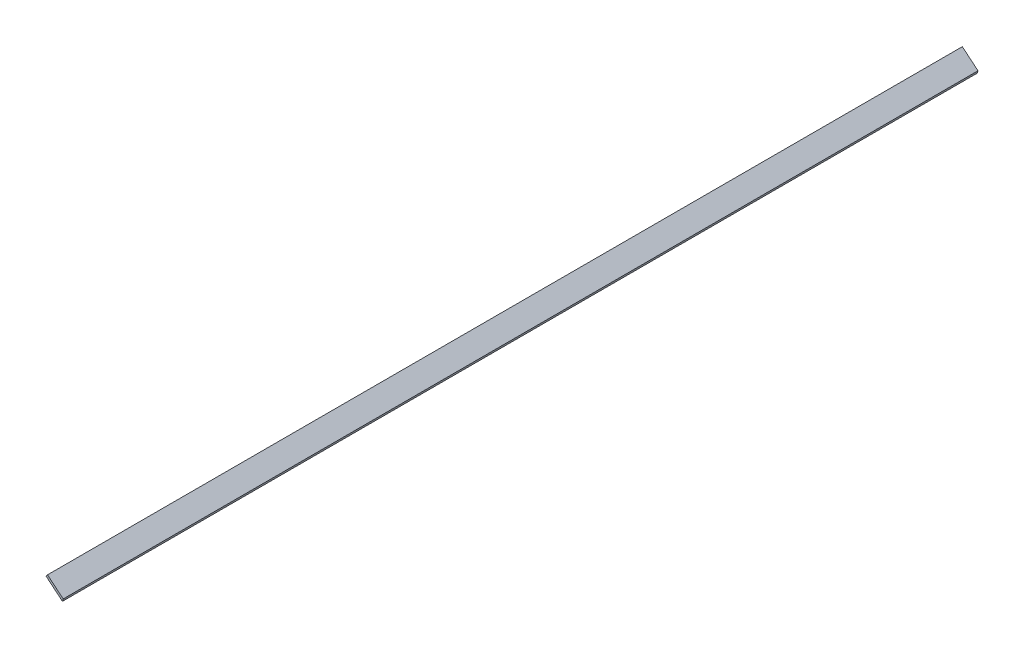
ISO-10303-21;
HEADER;
FILE_DESCRIPTION(('STEP AP214'),'2;1');
FILE_NAME('part.step','',(''),(''),'','','');
FILE_SCHEMA(('AUTOMOTIVE_DESIGN { 1 0 10303 214 1 1 1 1 }'));
ENDSEC;
DATA;
#1=APPLICATION_CONTEXT('core data for automotive mechanical design processes');
#2=APPLICATION_PROTOCOL_DEFINITION('international standard','automotive_design',2000,#1);
#3=PRODUCT_CONTEXT('',#1,'mechanical');
#4=PRODUCT('Part','Part','',(#3));
#5=PRODUCT_RELATED_PRODUCT_CATEGORY('part','',(#4));
#6=PRODUCT_DEFINITION_FORMATION('','',#4);
#7=PRODUCT_DEFINITION_CONTEXT('part definition',#1,'design');
#8=PRODUCT_DEFINITION('design','',#6,#7);
#9=PRODUCT_DEFINITION_SHAPE('','',#8);
#10=(LENGTH_UNIT() NAMED_UNIT(*) SI_UNIT(.MILLI.,.METRE.));
#11=(NAMED_UNIT(*) PLANE_ANGLE_UNIT() SI_UNIT($,.RADIAN.));
#12=(NAMED_UNIT(*) SI_UNIT($,.STERADIAN.) SOLID_ANGLE_UNIT());
#13=UNCERTAINTY_MEASURE_WITH_UNIT(LENGTH_MEASURE(1.E-05),#10,'distance_accuracy_value','');
#14=(GEOMETRIC_REPRESENTATION_CONTEXT(3) GLOBAL_UNCERTAINTY_ASSIGNED_CONTEXT((#13)) GLOBAL_UNIT_ASSIGNED_CONTEXT((#10,
#11,#12)) REPRESENTATION_CONTEXT('',''));
#15=CARTESIAN_POINT('',(0.,0.,0.));
#16=DIRECTION('',(0.,0.,1.));
#17=DIRECTION('',(1.,0.,0.));
#18=AXIS2_PLACEMENT_3D('',#15,#16,#17);
#19=CARTESIAN_POINT('',(-16.1960431473178,13.4958849420933,901.7));
#20=DIRECTION('',(0.640161509443756,0.768240354203482,0.));
#21=DIRECTION('',(-0.768240354203482,0.640161509443756,0.));
#22=AXIS2_PLACEMENT_3D('',#19,#20,#21);
#23=PLANE('',#22);
#24=DIRECTION('',(0.768240354203482,-0.640161509443756,0.));
#25=VECTOR('',#24,1.);
#26=CARTESIAN_POINT('',(-16.1960431473178,13.4958849420933,0.));
#27=LINE('',#26,#25);
#28=CARTESIAN_POINT('',(-16.1960431473178,13.4958849420933,0.));
#29=VERTEX_POINT('',#28);
#30=CARTESIAN_POINT('',(0.,0.,0.));
#31=VERTEX_POINT('',#30);
#32=EDGE_CURVE('E98',#29,#31,#27,.T.);
#33=ORIENTED_EDGE('',*,*,#32,.T.);
#34=DIRECTION('',(0.,0.,-1.));
#35=VECTOR('',#34,1.);
#36=CARTESIAN_POINT('',(0.,0.,901.7));
#37=LINE('',#36,#35);
#38=CARTESIAN_POINT('',(0.,0.,901.7));
#39=VERTEX_POINT('',#38);
#40=EDGE_CURVE('E11',#39,#31,#37,.T.);
#41=ORIENTED_EDGE('',*,*,#40,.F.);
#42=DIRECTION('',(0.768240354203482,-0.640161509443756,0.));
#43=VECTOR('',#42,1.);
#44=CARTESIAN_POINT('',(-16.1960431473178,13.4958849420933,901.7));
#45=LINE('',#44,#43);
#46=CARTESIAN_POINT('',(-16.1960431473178,13.4958849420933,901.7));
#47=VERTEX_POINT('',#46);
#48=EDGE_CURVE('E86',#47,#39,#45,.T.);
#49=ORIENTED_EDGE('',*,*,#48,.F.);
#50=DIRECTION('',(0.,0.,-1.));
#51=VECTOR('',#50,1.);
#52=CARTESIAN_POINT('',(-16.1960431473178,13.4958849420933,901.7));
#53=LINE('',#52,#51);
#54=EDGE_CURVE('E94',#47,#29,#53,.T.);
#55=ORIENTED_EDGE('',*,*,#54,.T.);
#56=EDGE_LOOP('',(#33,#41,#49,#55));
#57=FACE_BOUND('',#56,.T.);
#58=ADVANCED_FACE('F35',(#57),#23,.F.);
#59=CARTESIAN_POINT('',(0.,0.,901.7));
#60=DIRECTION('',(-0.954740742999773,0.297439260448652,0.));
#61=DIRECTION('',(-0.297439260448652,-0.954740742999773,0.));
#62=AXIS2_PLACEMENT_3D('',#59,#60,#61);
#63=PLANE('',#62);
#64=DIRECTION('',(0.297439260448652,0.954740742999773,0.));
#65=VECTOR('',#64,1.);
#66=CARTESIAN_POINT('',(0.,0.,0.));
#67=LINE('',#66,#65);
#68=CARTESIAN_POINT('',(0.760500689004303,2.44110677177115,0.));
#69=VERTEX_POINT('',#68);
#70=EDGE_CURVE('E90',#31,#69,#67,.T.);
#71=ORIENTED_EDGE('',*,*,#70,.T.);
#72=DIRECTION('',(0.,0.,-1.));
#73=VECTOR('',#72,1.);
#74=CARTESIAN_POINT('',(0.760500689004303,2.44110677177115,901.7));
#75=LINE('',#74,#73);
#76=CARTESIAN_POINT('',(0.760500689004303,2.44110677177115,901.7));
#77=VERTEX_POINT('',#76);
#78=EDGE_CURVE('E43',#77,#69,#75,.T.);
#79=ORIENTED_EDGE('',*,*,#78,.F.);
#80=DIRECTION('',(0.297439260448652,0.954740742999773,0.));
#81=VECTOR('',#80,1.);
#82=CARTESIAN_POINT('',(0.,0.,901.7));
#83=LINE('',#82,#81);
#84=EDGE_CURVE('E81',#39,#77,#83,.T.);
#85=ORIENTED_EDGE('',*,*,#84,.F.);
#86=ORIENTED_EDGE('',*,*,#40,.T.);
#87=EDGE_LOOP('',(#71,#79,#85,#86));
#88=FACE_BOUND('',#87,.T.);
#89=ADVANCED_FACE('F89',(#88),#63,.F.);
#90=CARTESIAN_POINT('',(0.760500689004303,2.44110677177115,901.7));
#91=DIRECTION('',(-0.640161509443756,-0.768240354203482,0.));
#92=DIRECTION('',(0.768240354203482,-0.640161509443756,0.));
#93=AXIS2_PLACEMENT_3D('',#90,#91,#92);
#94=PLANE('',#93);
#95=DIRECTION('',(-0.768240354203482,0.640161509443756,0.));
#96=VECTOR('',#95,1.);
#97=CARTESIAN_POINT('',(0.760500689004303,2.44110677177115,0.));
#98=LINE('',#97,#96);
#99=CARTESIAN_POINT('',(-14.6838536297098,15.3106223067927,0.));
#100=VERTEX_POINT('',#99);
#101=EDGE_CURVE('E68',#69,#100,#98,.T.);
#102=ORIENTED_EDGE('',*,*,#101,.T.);
#103=DIRECTION('',(0.,0.,-1.));
#104=VECTOR('',#103,1.);
#105=CARTESIAN_POINT('',(-14.6838536297098,15.3106223067927,901.7));
#106=LINE('',#105,#104);
#107=CARTESIAN_POINT('',(-14.6838536297098,15.3106223067927,901.7));
#108=VERTEX_POINT('',#107);
#109=EDGE_CURVE('E91',#108,#100,#106,.T.);
#110=ORIENTED_EDGE('',*,*,#109,.F.);
#111=DIRECTION('',(-0.768240354203482,0.640161509443756,0.));
#112=VECTOR('',#111,1.);
#113=CARTESIAN_POINT('',(0.760500689004303,2.44110677177115,901.7));
#114=LINE('',#113,#112);
#115=EDGE_CURVE('E84',#77,#108,#114,.T.);
#116=ORIENTED_EDGE('',*,*,#115,.F.);
#117=ORIENTED_EDGE('',*,*,#78,.T.);
#118=EDGE_LOOP('',(#102,#110,#116,#117));
#119=FACE_BOUND('',#118,.T.);
#120=ADVANCED_FACE('F92',(#119),#94,.F.);
#121=CARTESIAN_POINT('',(-14.6838536297098,15.3106223067927,901.7));
#122=DIRECTION('',(0.76824035420348,-0.640161509443758,0.));
#123=DIRECTION('',(0.640161509443758,0.76824035420348,0.));
#124=AXIS2_PLACEMENT_3D('',#121,#122,#123);
#125=PLANE('',#124);
#126=DIRECTION('',(-0.640161509443758,-0.76824035420348,0.));
#127=VECTOR('',#126,1.);
#128=CARTESIAN_POINT('',(-14.6838536297098,15.3106223067927,0.));
#129=LINE('',#128,#127);
#130=EDGE_CURVE('E74',#100,#29,#129,.T.);
#131=ORIENTED_EDGE('',*,*,#130,.T.);
#132=ORIENTED_EDGE('',*,*,#54,.F.);
#133=DIRECTION('',(-0.640161509443758,-0.76824035420348,0.));
#134=VECTOR('',#133,1.);
#135=CARTESIAN_POINT('',(-14.6838536297098,15.3106223067927,901.7));
#136=LINE('',#135,#134);
#137=EDGE_CURVE('E51',#108,#47,#136,.T.);
#138=ORIENTED_EDGE('',*,*,#137,.F.);
#139=ORIENTED_EDGE('',*,*,#109,.T.);
#140=EDGE_LOOP('',(#131,#132,#138,#139));
#141=FACE_BOUND('',#140,.T.);
#142=ADVANCED_FACE('F105',(#141),#125,.F.);
#143=CARTESIAN_POINT('',(0.,0.,901.7));
#144=DIRECTION('',(0.,0.,-1.));
#145=DIRECTION('',(-1.,0.,0.));
#146=AXIS2_PLACEMENT_3D('',#143,#144,#145);
#147=PLANE('',#146);
#148=ORIENTED_EDGE('',*,*,#48,.T.);
#149=ORIENTED_EDGE('',*,*,#84,.T.);
#150=ORIENTED_EDGE('',*,*,#115,.T.);
#151=ORIENTED_EDGE('',*,*,#137,.T.);
#152=EDGE_LOOP('',(#148,#149,#150,#151));
#153=FACE_BOUND('',#152,.T.);
#154=ADVANCED_FACE('F82',(#153),#147,.F.);
#155=CARTESIAN_POINT('',(0.,0.,0.));
#156=DIRECTION('',(0.,0.,-1.));
#157=DIRECTION('',(-1.,0.,0.));
#158=AXIS2_PLACEMENT_3D('',#155,#156,#157);
#159=PLANE('',#158);
#160=ORIENTED_EDGE('',*,*,#32,.F.);
#161=ORIENTED_EDGE('',*,*,#130,.F.);
#162=ORIENTED_EDGE('',*,*,#101,.F.);
#163=ORIENTED_EDGE('',*,*,#70,.F.);
#164=EDGE_LOOP('',(#160,#161,#162,#163));
#165=FACE_BOUND('',#164,.T.);
#166=ADVANCED_FACE('F108',(#165),#159,.T.);
#167=CLOSED_SHELL('',(#58,#89,#120,#142,#154,#166));
#168=MANIFOLD_SOLID_BREP('B2',#167);
#169=ADVANCED_BREP_SHAPE_REPRESENTATION('',(#18,#168),#14);
#170=SHAPE_DEFINITION_REPRESENTATION(#9,#169);
ENDSEC;
END-ISO-10303-21;
